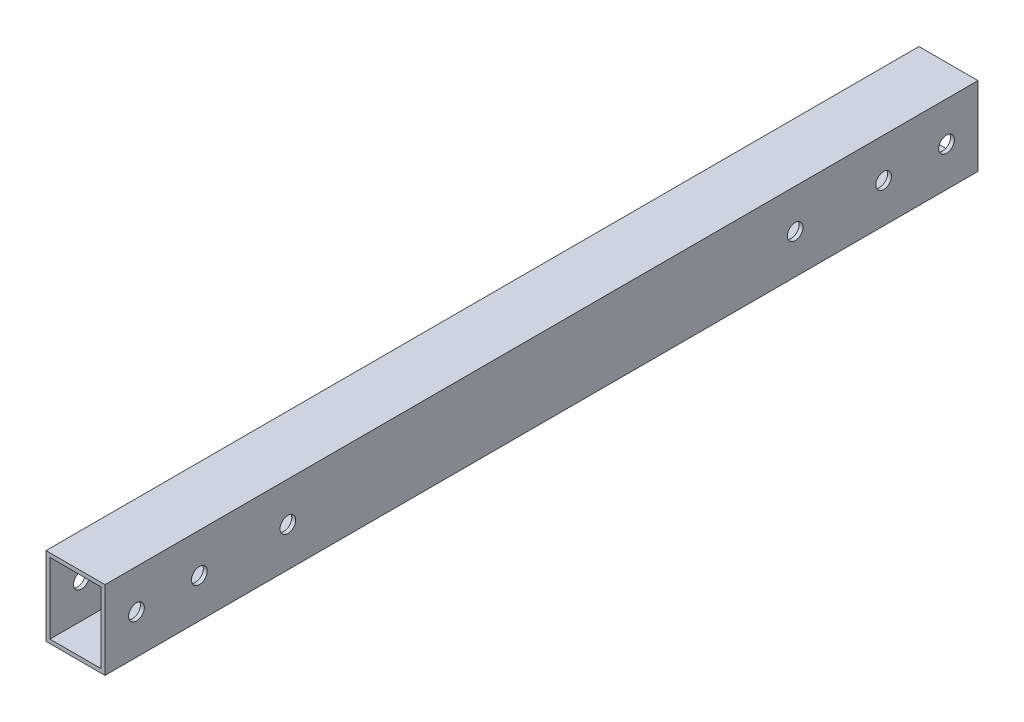
ISO-10303-21;
HEADER;
FILE_DESCRIPTION(('STEP AP214'),'2;1');
FILE_NAME('part.step','',(''),(''),'','','');
FILE_SCHEMA(('AUTOMOTIVE_DESIGN { 1 0 10303 214 1 1 1 1 }'));
ENDSEC;
DATA;
#1=APPLICATION_CONTEXT('core data for automotive mechanical design processes');
#2=APPLICATION_PROTOCOL_DEFINITION('international standard','automotive_design',2000,#1);
#3=PRODUCT_CONTEXT('',#1,'mechanical');
#4=PRODUCT('Part','Part','',(#3));
#5=PRODUCT_RELATED_PRODUCT_CATEGORY('part','',(#4));
#6=PRODUCT_DEFINITION_FORMATION('','',#4);
#7=PRODUCT_DEFINITION_CONTEXT('part definition',#1,'design');
#8=PRODUCT_DEFINITION('design','',#6,#7);
#9=PRODUCT_DEFINITION_SHAPE('','',#8);
#10=(LENGTH_UNIT() NAMED_UNIT(*) SI_UNIT(.MILLI.,.METRE.));
#11=(NAMED_UNIT(*) PLANE_ANGLE_UNIT() SI_UNIT($,.RADIAN.));
#12=(NAMED_UNIT(*) SI_UNIT($,.STERADIAN.) SOLID_ANGLE_UNIT());
#13=UNCERTAINTY_MEASURE_WITH_UNIT(LENGTH_MEASURE(1.E-05),#10,'distance_accuracy_value','');
#14=(GEOMETRIC_REPRESENTATION_CONTEXT(3) GLOBAL_UNCERTAINTY_ASSIGNED_CONTEXT((#13)) GLOBAL_UNIT_ASSIGNED_CONTEXT((#10,
#11,#12)) REPRESENTATION_CONTEXT('',''));
#15=CARTESIAN_POINT('',(0.,0.,0.));
#16=DIRECTION('',(0.,0.,1.));
#17=DIRECTION('',(1.,0.,0.));
#18=AXIS2_PLACEMENT_3D('',#15,#16,#17);
#19=CARTESIAN_POINT('',(0.,0.,444.));
#20=DIRECTION('',(0.,0.,-1.));
#21=DIRECTION('',(-1.,0.,0.));
#22=AXIS2_PLACEMENT_3D('',#19,#20,#21);
#23=PLANE('',#22);
#24=DIRECTION('',(0.,-1.,0.));
#25=VECTOR('',#24,1.);
#26=CARTESIAN_POINT('',(-18.0632084106622,-20.6910530782577,444.));
#27=LINE('',#26,#25);
#28=CARTESIAN_POINT('',(-18.0632084106622,19.3089469217423,444.));
#29=VERTEX_POINT('',#28);
#30=CARTESIAN_POINT('',(-18.0632084106622,-20.6910530782577,444.));
#31=VERTEX_POINT('',#30);
#32=EDGE_CURVE('E138',#29,#31,#27,.T.);
#33=ORIENTED_EDGE('',*,*,#32,.T.);
#34=DIRECTION('',(1.,0.,0.));
#35=VECTOR('',#34,1.);
#36=CARTESIAN_POINT('',(11.9367915893378,-20.6910530782577,444.));
#37=LINE('',#36,#35);
#38=CARTESIAN_POINT('',(11.9367915893378,-20.6910530782577,444.));
#39=VERTEX_POINT('',#38);
#40=EDGE_CURVE('E141',#31,#39,#37,.T.);
#41=ORIENTED_EDGE('',*,*,#40,.T.);
#42=DIRECTION('',(0.,1.,0.));
#43=VECTOR('',#42,1.);
#44=CARTESIAN_POINT('',(11.9367915893378,19.3089469217423,444.));
#45=LINE('',#44,#43);
#46=CARTESIAN_POINT('',(11.9367915893378,19.3089469217423,444.));
#47=VERTEX_POINT('',#46);
#48=EDGE_CURVE('E144',#39,#47,#45,.T.);
#49=ORIENTED_EDGE('',*,*,#48,.T.);
#50=DIRECTION('',(-1.,0.,0.));
#51=VECTOR('',#50,1.);
#52=CARTESIAN_POINT('',(-18.0632084106622,19.3089469217423,444.));
#53=LINE('',#52,#51);
#54=EDGE_CURVE('E146',#47,#29,#53,.T.);
#55=ORIENTED_EDGE('',*,*,#54,.T.);
#56=EDGE_LOOP('',(#33,#41,#49,#55));
#57=FACE_BOUND('',#56,.T.);
#58=DIRECTION('',(0.,-1.,0.));
#59=VECTOR('',#58,1.);
#60=CARTESIAN_POINT('',(-16.0632084106622,-18.6910530782577,444.));
#61=LINE('',#60,#59);
#62=CARTESIAN_POINT('',(-16.0632084106622,17.3089469217423,444.));
#63=VERTEX_POINT('',#62);
#64=CARTESIAN_POINT('',(-16.0632084106622,-18.6910530782577,444.));
#65=VERTEX_POINT('',#64);
#66=EDGE_CURVE('E100',#63,#65,#61,.T.);
#67=ORIENTED_EDGE('',*,*,#66,.F.);
#68=DIRECTION('',(-1.,0.,0.));
#69=VECTOR('',#68,1.);
#70=CARTESIAN_POINT('',(-16.0632084106622,17.3089469217423,444.));
#71=LINE('',#70,#69);
#72=CARTESIAN_POINT('',(9.93679158933783,17.3089469217423,444.));
#73=VERTEX_POINT('',#72);
#74=EDGE_CURVE('E122',#73,#63,#71,.T.);
#75=ORIENTED_EDGE('',*,*,#74,.F.);
#76=DIRECTION('',(0.,1.,0.));
#77=VECTOR('',#76,1.);
#78=CARTESIAN_POINT('',(9.93679158933783,17.3089469217423,444.));
#79=LINE('',#78,#77);
#80=CARTESIAN_POINT('',(9.93679158933783,-18.6910530782577,444.));
#81=VERTEX_POINT('',#80);
#82=EDGE_CURVE('E120',#81,#73,#79,.T.);
#83=ORIENTED_EDGE('',*,*,#82,.F.);
#84=DIRECTION('',(1.,0.,0.));
#85=VECTOR('',#84,1.);
#86=CARTESIAN_POINT('',(9.93679158933783,-18.6910530782577,444.));
#87=LINE('',#86,#85);
#88=EDGE_CURVE('E108',#65,#81,#87,.T.);
#89=ORIENTED_EDGE('',*,*,#88,.F.);
#90=EDGE_LOOP('',(#67,#75,#83,#89));
#91=FACE_BOUND('',#90,.T.);
#92=ADVANCED_FACE('F33',(#57,#91),#23,.F.);
#93=CARTESIAN_POINT('',(0.,0.,0.));
#94=DIRECTION('',(0.,0.,-1.));
#95=DIRECTION('',(-1.,0.,0.));
#96=AXIS2_PLACEMENT_3D('',#93,#94,#95);
#97=PLANE('',#96);
#98=DIRECTION('',(0.,-1.,0.));
#99=VECTOR('',#98,1.);
#100=CARTESIAN_POINT('',(-18.0632084106622,-20.6910530782577,0.));
#101=LINE('',#100,#99);
#102=CARTESIAN_POINT('',(-18.0632084106622,19.3089469217423,0.));
#103=VERTEX_POINT('',#102);
#104=CARTESIAN_POINT('',(-18.0632084106622,-20.6910530782577,0.));
#105=VERTEX_POINT('',#104);
#106=EDGE_CURVE('E116',#103,#105,#101,.T.);
#107=ORIENTED_EDGE('',*,*,#106,.F.);
#108=DIRECTION('',(-1.,0.,0.));
#109=VECTOR('',#108,1.);
#110=CARTESIAN_POINT('',(-18.0632084106622,19.3089469217423,0.));
#111=LINE('',#110,#109);
#112=CARTESIAN_POINT('',(11.9367915893378,19.3089469217423,0.));
#113=VERTEX_POINT('',#112);
#114=EDGE_CURVE('E142',#113,#103,#111,.T.);
#115=ORIENTED_EDGE('',*,*,#114,.F.);
#116=DIRECTION('',(0.,1.,0.));
#117=VECTOR('',#116,1.);
#118=CARTESIAN_POINT('',(11.9367915893378,19.3089469217423,0.));
#119=LINE('',#118,#117);
#120=CARTESIAN_POINT('',(11.9367915893378,-20.6910530782577,0.));
#121=VERTEX_POINT('',#120);
#122=EDGE_CURVE('E153',#121,#113,#119,.T.);
#123=ORIENTED_EDGE('',*,*,#122,.F.);
#124=DIRECTION('',(1.,0.,0.));
#125=VECTOR('',#124,1.);
#126=CARTESIAN_POINT('',(11.9367915893378,-20.6910530782577,0.));
#127=LINE('',#126,#125);
#128=EDGE_CURVE('E151',#105,#121,#127,.T.);
#129=ORIENTED_EDGE('',*,*,#128,.F.);
#130=EDGE_LOOP('',(#107,#115,#123,#129));
#131=FACE_BOUND('',#130,.T.);
#132=DIRECTION('',(-1.,0.,0.));
#133=VECTOR('',#132,1.);
#134=CARTESIAN_POINT('',(-16.0632084106622,17.3089469217423,0.));
#135=LINE('',#134,#133);
#136=CARTESIAN_POINT('',(9.93679158933783,17.3089469217423,0.));
#137=VERTEX_POINT('',#136);
#138=CARTESIAN_POINT('',(-16.0632084106622,17.3089469217423,0.));
#139=VERTEX_POINT('',#138);
#140=EDGE_CURVE('E109',#137,#139,#135,.T.);
#141=ORIENTED_EDGE('',*,*,#140,.T.);
#142=DIRECTION('',(0.,-1.,0.));
#143=VECTOR('',#142,1.);
#144=CARTESIAN_POINT('',(-16.0632084106622,-18.6910530782577,0.));
#145=LINE('',#144,#143);
#146=CARTESIAN_POINT('',(-16.0632084106622,-18.6910530782577,0.));
#147=VERTEX_POINT('',#146);
#148=EDGE_CURVE('E58',#139,#147,#145,.T.);
#149=ORIENTED_EDGE('',*,*,#148,.T.);
#150=DIRECTION('',(1.,0.,0.));
#151=VECTOR('',#150,1.);
#152=CARTESIAN_POINT('',(9.93679158933783,-18.6910530782577,0.));
#153=LINE('',#152,#151);
#154=CARTESIAN_POINT('',(9.93679158933783,-18.6910530782577,0.));
#155=VERTEX_POINT('',#154);
#156=EDGE_CURVE('E115',#147,#155,#153,.T.);
#157=ORIENTED_EDGE('',*,*,#156,.T.);
#158=DIRECTION('',(0.,1.,0.));
#159=VECTOR('',#158,1.);
#160=CARTESIAN_POINT('',(9.93679158933783,17.3089469217423,0.));
#161=LINE('',#160,#159);
#162=EDGE_CURVE('E130',#155,#137,#161,.T.);
#163=ORIENTED_EDGE('',*,*,#162,.T.);
#164=EDGE_LOOP('',(#141,#149,#157,#163));
#165=FACE_BOUND('',#164,.T.);
#166=ADVANCED_FACE('F232',(#131,#165),#97,.T.);
#167=CARTESIAN_POINT('',(-18.0632084106622,-20.6910530782577,444.));
#168=DIRECTION('',(1.,0.,0.));
#169=DIRECTION('',(0.,0.,-1.));
#170=AXIS2_PLACEMENT_3D('',#167,#168,#169);
#171=PLANE('',#170);
#172=CARTESIAN_POINT('',(-18.0632084106622,-0.69105307825773,92.9999999999596));
#173=DIRECTION('',(-1.,0.,0.));
#174=DIRECTION('',(0.,0.,1.));
#175=AXIS2_PLACEMENT_3D('',#172,#173,#174);
#176=CIRCLE('',#175,3.99999999999999);
#177=CARTESIAN_POINT('',(-18.0632084106622,-0.69105307825773,96.9999999999596));
#178=VERTEX_POINT('',#177);
#179=EDGE_CURVE('E348',#178,#178,#176,.T.);
#180=ORIENTED_EDGE('',*,*,#179,.F.);
#181=EDGE_LOOP('',(#180));
#182=FACE_BOUND('',#181,.T.);
#183=CARTESIAN_POINT('',(-18.0632084106622,-0.691053078257721,48.));
#184=DIRECTION('',(-1.,0.,0.));
#185=DIRECTION('',(0.,0.,-1.));
#186=AXIS2_PLACEMENT_3D('',#183,#184,#185);
#187=CIRCLE('',#186,3.99999999999999);
#188=CARTESIAN_POINT('',(-18.0632084106622,-0.691053078257721,44.));
#189=VERTEX_POINT('',#188);
#190=EDGE_CURVE('E346',#189,#189,#187,.T.);
#191=ORIENTED_EDGE('',*,*,#190,.F.);
#192=EDGE_LOOP('',(#191));
#193=FACE_BOUND('',#192,.T.);
#194=CARTESIAN_POINT('',(-18.0632084106622,-0.691053078257725,16.));
#195=DIRECTION('',(-1.,0.,0.));
#196=DIRECTION('',(0.,0.,-1.));
#197=AXIS2_PLACEMENT_3D('',#194,#195,#196);
#198=CIRCLE('',#197,3.99999999999999);
#199=CARTESIAN_POINT('',(-18.0632084106622,-0.691053078257725,12.));
#200=VERTEX_POINT('',#199);
#201=EDGE_CURVE('E342',#200,#200,#198,.T.);
#202=ORIENTED_EDGE('',*,*,#201,.F.);
#203=EDGE_LOOP('',(#202));
#204=FACE_BOUND('',#203,.T.);
#205=CARTESIAN_POINT('',(-18.0632084106622,-0.691053078257684,428.));
#206=DIRECTION('',(-1.,0.,0.));
#207=DIRECTION('',(0.,0.,1.));
#208=AXIS2_PLACEMENT_3D('',#205,#206,#207);
#209=CIRCLE('',#208,3.99999999999999);
#210=CARTESIAN_POINT('',(-18.0632084106622,-0.691053078257684,432.));
#211=VERTEX_POINT('',#210);
#212=EDGE_CURVE('E340',#211,#211,#209,.T.);
#213=ORIENTED_EDGE('',*,*,#212,.F.);
#214=EDGE_LOOP('',(#213));
#215=FACE_BOUND('',#214,.T.);
#216=CARTESIAN_POINT('',(-18.0632084106622,-0.691053078257716,351.00000000004));
#217=DIRECTION('',(-1.,0.,0.));
#218=DIRECTION('',(0.,0.,-1.));
#219=AXIS2_PLACEMENT_3D('',#216,#217,#218);
#220=CIRCLE('',#219,3.99999999999999);
#221=CARTESIAN_POINT('',(-18.0632084106622,-0.691053078257716,347.00000000004));
#222=VERTEX_POINT('',#221);
#223=EDGE_CURVE('E351',#222,#222,#220,.T.);
#224=ORIENTED_EDGE('',*,*,#223,.F.);
#225=EDGE_LOOP('',(#224));
#226=FACE_BOUND('',#225,.T.);
#227=CARTESIAN_POINT('',(-18.0632084106622,-0.691053078257688,396.));
#228=DIRECTION('',(-1.,0.,0.));
#229=DIRECTION('',(0.,0.,1.));
#230=AXIS2_PLACEMENT_3D('',#227,#228,#229);
#231=CIRCLE('',#230,3.99999999999999);
#232=CARTESIAN_POINT('',(-18.0632084106622,-0.691053078257688,400.));
#233=VERTEX_POINT('',#232);
#234=EDGE_CURVE('E167',#233,#233,#231,.T.);
#235=ORIENTED_EDGE('',*,*,#234,.F.);
#236=EDGE_LOOP('',(#235));
#237=FACE_BOUND('',#236,.T.);
#238=ORIENTED_EDGE('',*,*,#106,.T.);
#239=DIRECTION('',(0.,0.,-1.));
#240=VECTOR('',#239,1.);
#241=CARTESIAN_POINT('',(-18.0632084106622,-20.6910530782577,444.));
#242=LINE('',#241,#240);
#243=EDGE_CURVE('E11',#31,#105,#242,.T.);
#244=ORIENTED_EDGE('',*,*,#243,.F.);
#245=ORIENTED_EDGE('',*,*,#32,.F.);
#246=DIRECTION('',(0.,0.,-1.));
#247=VECTOR('',#246,1.);
#248=CARTESIAN_POINT('',(-18.0632084106622,19.3089469217423,444.));
#249=LINE('',#248,#247);
#250=EDGE_CURVE('E148',#29,#103,#249,.T.);
#251=ORIENTED_EDGE('',*,*,#250,.T.);
#252=EDGE_LOOP('',(#238,#244,#245,#251));
#253=FACE_BOUND('',#252,.T.);
#254=ADVANCED_FACE('F35',(#182,#193,#204,#215,#226,#237,#253),#171,.F.);
#255=CARTESIAN_POINT('',(11.9367915893378,-20.6910530782577,444.));
#256=DIRECTION('',(0.,1.,0.));
#257=DIRECTION('',(0.,0.,1.));
#258=AXIS2_PLACEMENT_3D('',#255,#256,#257);
#259=PLANE('',#258);
#260=ORIENTED_EDGE('',*,*,#128,.T.);
#261=DIRECTION('',(0.,0.,-1.));
#262=VECTOR('',#261,1.);
#263=CARTESIAN_POINT('',(11.9367915893378,-20.6910530782577,444.));
#264=LINE('',#263,#262);
#265=EDGE_CURVE('E42',#39,#121,#264,.T.);
#266=ORIENTED_EDGE('',*,*,#265,.F.);
#267=ORIENTED_EDGE('',*,*,#40,.F.);
#268=ORIENTED_EDGE('',*,*,#243,.T.);
#269=EDGE_LOOP('',(#260,#266,#267,#268));
#270=FACE_BOUND('',#269,.T.);
#271=ADVANCED_FACE('F248',(#270),#259,.F.);
#272=CARTESIAN_POINT('',(11.9367915893378,19.3089469217423,444.));
#273=DIRECTION('',(-1.,0.,0.));
#274=DIRECTION('',(0.,0.,1.));
#275=AXIS2_PLACEMENT_3D('',#272,#273,#274);
#276=PLANE('',#275);
#277=CARTESIAN_POINT('',(11.9367915893378,-0.69105307825773,92.9999999999596));
#278=DIRECTION('',(-1.,0.,0.));
#279=DIRECTION('',(0.,0.,1.));
#280=AXIS2_PLACEMENT_3D('',#277,#278,#279);
#281=CIRCLE('',#280,3.99999999999999);
#282=CARTESIAN_POINT('',(11.9367915893378,-0.69105307825773,96.9999999999596));
#283=VERTEX_POINT('',#282);
#284=EDGE_CURVE('E128',#283,#283,#281,.T.);
#285=ORIENTED_EDGE('',*,*,#284,.T.);
#286=EDGE_LOOP('',(#285));
#287=FACE_BOUND('',#286,.T.);
#288=CARTESIAN_POINT('',(11.9367915893378,-0.691053078257721,48.));
#289=DIRECTION('',(-1.,0.,0.));
#290=DIRECTION('',(0.,0.,1.));
#291=AXIS2_PLACEMENT_3D('',#288,#289,#290);
#292=CIRCLE('',#291,3.99999999999999);
#293=CARTESIAN_POINT('',(11.9367915893378,-0.691053078257721,52.));
#294=VERTEX_POINT('',#293);
#295=EDGE_CURVE('E189',#294,#294,#292,.T.);
#296=ORIENTED_EDGE('',*,*,#295,.T.);
#297=EDGE_LOOP('',(#296));
#298=FACE_BOUND('',#297,.T.);
#299=CARTESIAN_POINT('',(11.9367915893378,-0.691053078257725,16.));
#300=DIRECTION('',(-1.,0.,0.));
#301=DIRECTION('',(0.,0.,1.));
#302=AXIS2_PLACEMENT_3D('',#299,#300,#301);
#303=CIRCLE('',#302,3.99999999999999);
#304=CARTESIAN_POINT('',(11.9367915893378,-0.691053078257725,20.));
#305=VERTEX_POINT('',#304);
#306=EDGE_CURVE('E185',#305,#305,#303,.T.);
#307=ORIENTED_EDGE('',*,*,#306,.T.);
#308=EDGE_LOOP('',(#307));
#309=FACE_BOUND('',#308,.T.);
#310=CARTESIAN_POINT('',(11.9367915893378,-0.691053078257684,428.));
#311=DIRECTION('',(-1.,0.,0.));
#312=DIRECTION('',(0.,0.,1.));
#313=AXIS2_PLACEMENT_3D('',#310,#311,#312);
#314=CIRCLE('',#313,3.99999999999999);
#315=CARTESIAN_POINT('',(11.9367915893378,-0.691053078257684,432.));
#316=VERTEX_POINT('',#315);
#317=EDGE_CURVE('E181',#316,#316,#314,.T.);
#318=ORIENTED_EDGE('',*,*,#317,.T.);
#319=EDGE_LOOP('',(#318));
#320=FACE_BOUND('',#319,.T.);
#321=CARTESIAN_POINT('',(11.9367915893378,-0.691053078257716,351.00000000004));
#322=DIRECTION('',(-1.,0.,0.));
#323=DIRECTION('',(0.,0.,1.));
#324=AXIS2_PLACEMENT_3D('',#321,#322,#323);
#325=CIRCLE('',#324,3.99999999999999);
#326=CARTESIAN_POINT('',(11.9367915893378,-0.691053078257716,355.00000000004));
#327=VERTEX_POINT('',#326);
#328=EDGE_CURVE('E177',#327,#327,#325,.T.);
#329=ORIENTED_EDGE('',*,*,#328,.T.);
#330=EDGE_LOOP('',(#329));
#331=FACE_BOUND('',#330,.T.);
#332=CARTESIAN_POINT('',(11.9367915893378,-0.691053078257688,396.));
#333=DIRECTION('',(-1.,0.,0.));
#334=DIRECTION('',(0.,0.,1.));
#335=AXIS2_PLACEMENT_3D('',#332,#333,#334);
#336=CIRCLE('',#335,3.99999999999999);
#337=CARTESIAN_POINT('',(11.9367915893378,-0.691053078257688,400.));
#338=VERTEX_POINT('',#337);
#339=EDGE_CURVE('E172',#338,#338,#336,.T.);
#340=ORIENTED_EDGE('',*,*,#339,.T.);
#341=EDGE_LOOP('',(#340));
#342=FACE_BOUND('',#341,.T.);
#343=ORIENTED_EDGE('',*,*,#122,.T.);
#344=DIRECTION('',(0.,0.,-1.));
#345=VECTOR('',#344,1.);
#346=CARTESIAN_POINT('',(11.9367915893378,19.3089469217423,444.));
#347=LINE('',#346,#345);
#348=EDGE_CURVE('E158',#47,#113,#347,.T.);
#349=ORIENTED_EDGE('',*,*,#348,.F.);
#350=ORIENTED_EDGE('',*,*,#48,.F.);
#351=ORIENTED_EDGE('',*,*,#265,.T.);
#352=EDGE_LOOP('',(#343,#349,#350,#351));
#353=FACE_BOUND('',#352,.T.);
#354=ADVANCED_FACE('F206',(#287,#298,#309,#320,#331,#342,#353),#276,.F.);
#355=CARTESIAN_POINT('',(-18.0632084106622,19.3089469217423,444.));
#356=DIRECTION('',(0.,-1.,0.));
#357=DIRECTION('',(0.,0.,-1.));
#358=AXIS2_PLACEMENT_3D('',#355,#356,#357);
#359=PLANE('',#358);
#360=ORIENTED_EDGE('',*,*,#114,.T.);
#361=ORIENTED_EDGE('',*,*,#250,.F.);
#362=ORIENTED_EDGE('',*,*,#54,.F.);
#363=ORIENTED_EDGE('',*,*,#348,.T.);
#364=EDGE_LOOP('',(#360,#361,#362,#363));
#365=FACE_BOUND('',#364,.T.);
#366=ADVANCED_FACE('F243',(#365),#359,.F.);
#367=CARTESIAN_POINT('',(-16.0632084106622,-18.6910530782577,444.));
#368=DIRECTION('',(1.,0.,0.));
#369=DIRECTION('',(0.,0.,-1.));
#370=AXIS2_PLACEMENT_3D('',#367,#368,#369);
#371=PLANE('',#370);
#372=CARTESIAN_POINT('',(-16.0632084106622,-0.69105307825773,92.9999999999596));
#373=DIRECTION('',(1.,0.,0.));
#374=DIRECTION('',(0.,0.,-1.));
#375=AXIS2_PLACEMENT_3D('',#372,#373,#374);
#376=CIRCLE('',#375,3.99999999999999);
#377=CARTESIAN_POINT('',(-16.0632084106622,-0.69105307825773,88.9999999999596));
#378=VERTEX_POINT('',#377);
#379=EDGE_CURVE('E201',#378,#378,#376,.T.);
#380=ORIENTED_EDGE('',*,*,#379,.F.);
#381=EDGE_LOOP('',(#380));
#382=FACE_BOUND('',#381,.T.);
#383=CARTESIAN_POINT('',(-16.0632084106622,-0.691053078257721,48.));
#384=DIRECTION('',(1.,0.,0.));
#385=DIRECTION('',(0.,0.,-1.));
#386=AXIS2_PLACEMENT_3D('',#383,#384,#385);
#387=CIRCLE('',#386,3.99999999999999);
#388=CARTESIAN_POINT('',(-16.0632084106622,-0.691053078257721,44.));
#389=VERTEX_POINT('',#388);
#390=EDGE_CURVE('E184',#389,#389,#387,.T.);
#391=ORIENTED_EDGE('',*,*,#390,.F.);
#392=EDGE_LOOP('',(#391));
#393=FACE_BOUND('',#392,.T.);
#394=CARTESIAN_POINT('',(-16.0632084106622,-0.691053078257725,16.));
#395=DIRECTION('',(1.,0.,0.));
#396=DIRECTION('',(0.,0.,-1.));
#397=AXIS2_PLACEMENT_3D('',#394,#395,#396);
#398=CIRCLE('',#397,3.99999999999999);
#399=CARTESIAN_POINT('',(-16.0632084106622,-0.691053078257725,12.));
#400=VERTEX_POINT('',#399);
#401=EDGE_CURVE('E180',#400,#400,#398,.T.);
#402=ORIENTED_EDGE('',*,*,#401,.F.);
#403=EDGE_LOOP('',(#402));
#404=FACE_BOUND('',#403,.T.);
#405=CARTESIAN_POINT('',(-16.0632084106622,-0.691053078257684,428.));
#406=DIRECTION('',(1.,0.,0.));
#407=DIRECTION('',(0.,0.,-1.));
#408=AXIS2_PLACEMENT_3D('',#405,#406,#407);
#409=CIRCLE('',#408,3.99999999999999);
#410=CARTESIAN_POINT('',(-16.0632084106622,-0.691053078257684,424.));
#411=VERTEX_POINT('',#410);
#412=EDGE_CURVE('E176',#411,#411,#409,.T.);
#413=ORIENTED_EDGE('',*,*,#412,.F.);
#414=EDGE_LOOP('',(#413));
#415=FACE_BOUND('',#414,.T.);
#416=CARTESIAN_POINT('',(-16.0632084106622,-0.691053078257716,351.00000000004));
#417=DIRECTION('',(1.,0.,0.));
#418=DIRECTION('',(0.,0.,-1.));
#419=AXIS2_PLACEMENT_3D('',#416,#417,#418);
#420=CIRCLE('',#419,3.99999999999999);
#421=CARTESIAN_POINT('',(-16.0632084106622,-0.691053078257716,347.00000000004));
#422=VERTEX_POINT('',#421);
#423=EDGE_CURVE('E171',#422,#422,#420,.T.);
#424=ORIENTED_EDGE('',*,*,#423,.F.);
#425=EDGE_LOOP('',(#424));
#426=FACE_BOUND('',#425,.T.);
#427=CARTESIAN_POINT('',(-16.0632084106622,-0.691053078257688,396.));
#428=DIRECTION('',(1.,0.,0.));
#429=DIRECTION('',(0.,0.,-1.));
#430=AXIS2_PLACEMENT_3D('',#427,#428,#429);
#431=CIRCLE('',#430,3.99999999999999);
#432=CARTESIAN_POINT('',(-16.0632084106622,-0.691053078257688,392.));
#433=VERTEX_POINT('',#432);
#434=EDGE_CURVE('E166',#433,#433,#431,.T.);
#435=ORIENTED_EDGE('',*,*,#434,.F.);
#436=EDGE_LOOP('',(#435));
#437=FACE_BOUND('',#436,.T.);
#438=ORIENTED_EDGE('',*,*,#148,.F.);
#439=DIRECTION('',(0.,0.,-1.));
#440=VECTOR('',#439,1.);
#441=CARTESIAN_POINT('',(-16.0632084106622,17.3089469217423,444.));
#442=LINE('',#441,#440);
#443=EDGE_CURVE('E104',#63,#139,#442,.T.);
#444=ORIENTED_EDGE('',*,*,#443,.F.);
#445=ORIENTED_EDGE('',*,*,#66,.T.);
#446=DIRECTION('',(0.,0.,-1.));
#447=VECTOR('',#446,1.);
#448=CARTESIAN_POINT('',(-16.0632084106622,-18.6910530782577,444.));
#449=LINE('',#448,#447);
#450=EDGE_CURVE('E103',#65,#147,#449,.T.);
#451=ORIENTED_EDGE('',*,*,#450,.T.);
#452=EDGE_LOOP('',(#438,#444,#445,#451));
#453=FACE_BOUND('',#452,.T.);
#454=ADVANCED_FACE('F102',(#382,#393,#404,#415,#426,#437,#453),#371,.T.);
#455=CARTESIAN_POINT('',(9.93679158933783,-18.6910530782577,444.));
#456=DIRECTION('',(0.,1.,0.));
#457=DIRECTION('',(0.,0.,1.));
#458=AXIS2_PLACEMENT_3D('',#455,#456,#457);
#459=PLANE('',#458);
#460=ORIENTED_EDGE('',*,*,#156,.F.);
#461=ORIENTED_EDGE('',*,*,#450,.F.);
#462=ORIENTED_EDGE('',*,*,#88,.T.);
#463=DIRECTION('',(0.,0.,-1.));
#464=VECTOR('',#463,1.);
#465=CARTESIAN_POINT('',(9.93679158933783,-18.6910530782577,444.));
#466=LINE('',#465,#464);
#467=EDGE_CURVE('E117',#81,#155,#466,.T.);
#468=ORIENTED_EDGE('',*,*,#467,.T.);
#469=EDGE_LOOP('',(#460,#461,#462,#468));
#470=FACE_BOUND('',#469,.T.);
#471=ADVANCED_FACE('F112',(#470),#459,.T.);
#472=CARTESIAN_POINT('',(9.93679158933783,17.3089469217423,444.));
#473=DIRECTION('',(-1.,0.,0.));
#474=DIRECTION('',(0.,0.,1.));
#475=AXIS2_PLACEMENT_3D('',#472,#473,#474);
#476=PLANE('',#475);
#477=CARTESIAN_POINT('',(9.93679158933783,-0.69105307825773,92.9999999999596));
#478=DIRECTION('',(-1.,0.,0.));
#479=DIRECTION('',(0.,0.,1.));
#480=AXIS2_PLACEMENT_3D('',#477,#478,#479);
#481=CIRCLE('',#480,3.99999999999999);
#482=CARTESIAN_POINT('',(9.93679158933783,-0.69105307825773,96.9999999999596));
#483=VERTEX_POINT('',#482);
#484=EDGE_CURVE('E37',#483,#483,#481,.T.);
#485=ORIENTED_EDGE('',*,*,#484,.F.);
#486=EDGE_LOOP('',(#485));
#487=FACE_BOUND('',#486,.T.);
#488=CARTESIAN_POINT('',(9.93679158933783,-0.691053078257721,48.));
#489=DIRECTION('',(-1.,0.,0.));
#490=DIRECTION('',(0.,0.,1.));
#491=AXIS2_PLACEMENT_3D('',#488,#489,#490);
#492=CIRCLE('',#491,3.99999999999999);
#493=CARTESIAN_POINT('',(9.93679158933783,-0.691053078257721,52.));
#494=VERTEX_POINT('',#493);
#495=EDGE_CURVE('E182',#494,#494,#492,.T.);
#496=ORIENTED_EDGE('',*,*,#495,.F.);
#497=EDGE_LOOP('',(#496));
#498=FACE_BOUND('',#497,.T.);
#499=CARTESIAN_POINT('',(9.93679158933783,-0.691053078257725,16.));
#500=DIRECTION('',(-1.,0.,0.));
#501=DIRECTION('',(0.,0.,1.));
#502=AXIS2_PLACEMENT_3D('',#499,#500,#501);
#503=CIRCLE('',#502,3.99999999999999);
#504=CARTESIAN_POINT('',(9.93679158933783,-0.691053078257725,20.));
#505=VERTEX_POINT('',#504);
#506=EDGE_CURVE('E178',#505,#505,#503,.T.);
#507=ORIENTED_EDGE('',*,*,#506,.F.);
#508=EDGE_LOOP('',(#507));
#509=FACE_BOUND('',#508,.T.);
#510=CARTESIAN_POINT('',(9.93679158933783,-0.691053078257684,428.));
#511=DIRECTION('',(-1.,0.,0.));
#512=DIRECTION('',(0.,0.,1.));
#513=AXIS2_PLACEMENT_3D('',#510,#511,#512);
#514=CIRCLE('',#513,3.99999999999999);
#515=CARTESIAN_POINT('',(9.93679158933783,-0.691053078257684,432.));
#516=VERTEX_POINT('',#515);
#517=EDGE_CURVE('E173',#516,#516,#514,.T.);
#518=ORIENTED_EDGE('',*,*,#517,.F.);
#519=EDGE_LOOP('',(#518));
#520=FACE_BOUND('',#519,.T.);
#521=CARTESIAN_POINT('',(9.93679158933783,-0.691053078257716,351.00000000004));
#522=DIRECTION('',(-1.,0.,0.));
#523=DIRECTION('',(0.,0.,1.));
#524=AXIS2_PLACEMENT_3D('',#521,#522,#523);
#525=CIRCLE('',#524,3.99999999999999);
#526=CARTESIAN_POINT('',(9.93679158933783,-0.691053078257716,355.00000000004));
#527=VERTEX_POINT('',#526);
#528=EDGE_CURVE('E168',#527,#527,#525,.T.);
#529=ORIENTED_EDGE('',*,*,#528,.F.);
#530=EDGE_LOOP('',(#529));
#531=FACE_BOUND('',#530,.T.);
#532=CARTESIAN_POINT('',(9.93679158933783,-0.691053078257688,396.));
#533=DIRECTION('',(-1.,0.,0.));
#534=DIRECTION('',(0.,0.,1.));
#535=AXIS2_PLACEMENT_3D('',#532,#533,#534);
#536=CIRCLE('',#535,3.99999999999999);
#537=CARTESIAN_POINT('',(9.93679158933783,-0.691053078257688,400.));
#538=VERTEX_POINT('',#537);
#539=EDGE_CURVE('E163',#538,#538,#536,.T.);
#540=ORIENTED_EDGE('',*,*,#539,.F.);
#541=EDGE_LOOP('',(#540));
#542=FACE_BOUND('',#541,.T.);
#543=ORIENTED_EDGE('',*,*,#162,.F.);
#544=ORIENTED_EDGE('',*,*,#467,.F.);
#545=ORIENTED_EDGE('',*,*,#82,.T.);
#546=DIRECTION('',(0.,0.,-1.));
#547=VECTOR('',#546,1.);
#548=CARTESIAN_POINT('',(9.93679158933783,17.3089469217423,444.));
#549=LINE('',#548,#547);
#550=EDGE_CURVE('E50',#73,#137,#549,.T.);
#551=ORIENTED_EDGE('',*,*,#550,.T.);
#552=EDGE_LOOP('',(#543,#544,#545,#551));
#553=FACE_BOUND('',#552,.T.);
#554=ADVANCED_FACE('F271',(#487,#498,#509,#520,#531,#542,#553),#476,.T.);
#555=CARTESIAN_POINT('',(-16.0632084106622,17.3089469217423,444.));
#556=DIRECTION('',(0.,-1.,0.));
#557=DIRECTION('',(0.,0.,-1.));
#558=AXIS2_PLACEMENT_3D('',#555,#556,#557);
#559=PLANE('',#558);
#560=ORIENTED_EDGE('',*,*,#140,.F.);
#561=ORIENTED_EDGE('',*,*,#550,.F.);
#562=ORIENTED_EDGE('',*,*,#74,.T.);
#563=ORIENTED_EDGE('',*,*,#443,.T.);
#564=EDGE_LOOP('',(#560,#561,#562,#563));
#565=FACE_BOUND('',#564,.T.);
#566=ADVANCED_FACE('F269',(#565),#559,.T.);
#567=CARTESIAN_POINT('',(77.9367915893379,-0.691053078257688,396.));
#568=DIRECTION('',(-1.,0.,0.));
#569=DIRECTION('',(0.,0.,1.));
#570=AXIS2_PLACEMENT_3D('',#567,#568,#569);
#571=CYLINDRICAL_SURFACE('',#570,3.99999999999999);
#572=ORIENTED_EDGE('',*,*,#539,.T.);
#573=EDGE_LOOP('',(#572));
#574=FACE_BOUND('',#573,.T.);
#575=ORIENTED_EDGE('',*,*,#339,.F.);
#576=EDGE_LOOP('',(#575));
#577=FACE_BOUND('',#576,.T.);
#578=ADVANCED_FACE('F223',(#574,#577),#571,.F.);
#579=CARTESIAN_POINT('',(77.9367915893379,-0.691053078257716,351.00000000004));
#580=DIRECTION('',(-1.,0.,0.));
#581=DIRECTION('',(0.,0.,1.));
#582=AXIS2_PLACEMENT_3D('',#579,#580,#581);
#583=CYLINDRICAL_SURFACE('',#582,3.99999999999999);
#584=ORIENTED_EDGE('',*,*,#528,.T.);
#585=EDGE_LOOP('',(#584));
#586=FACE_BOUND('',#585,.T.);
#587=ORIENTED_EDGE('',*,*,#328,.F.);
#588=EDGE_LOOP('',(#587));
#589=FACE_BOUND('',#588,.T.);
#590=ADVANCED_FACE('F277',(#586,#589),#583,.F.);
#591=CARTESIAN_POINT('',(77.9367915893379,-0.691053078257684,428.));
#592=DIRECTION('',(-1.,0.,0.));
#593=DIRECTION('',(0.,0.,1.));
#594=AXIS2_PLACEMENT_3D('',#591,#592,#593);
#595=CYLINDRICAL_SURFACE('',#594,3.99999999999999);
#596=ORIENTED_EDGE('',*,*,#517,.T.);
#597=EDGE_LOOP('',(#596));
#598=FACE_BOUND('',#597,.T.);
#599=ORIENTED_EDGE('',*,*,#317,.F.);
#600=EDGE_LOOP('',(#599));
#601=FACE_BOUND('',#600,.T.);
#602=ADVANCED_FACE('F317',(#598,#601),#595,.F.);
#603=CARTESIAN_POINT('',(77.9367915893379,-0.691053078257725,16.));
#604=DIRECTION('',(-1.,0.,0.));
#605=DIRECTION('',(0.,0.,1.));
#606=AXIS2_PLACEMENT_3D('',#603,#604,#605);
#607=CYLINDRICAL_SURFACE('',#606,3.99999999999999);
#608=ORIENTED_EDGE('',*,*,#506,.T.);
#609=EDGE_LOOP('',(#608));
#610=FACE_BOUND('',#609,.T.);
#611=ORIENTED_EDGE('',*,*,#306,.F.);
#612=EDGE_LOOP('',(#611));
#613=FACE_BOUND('',#612,.T.);
#614=ADVANCED_FACE('F224',(#610,#613),#607,.F.);
#615=CARTESIAN_POINT('',(77.9367915893379,-0.691053078257721,48.));
#616=DIRECTION('',(-1.,0.,0.));
#617=DIRECTION('',(0.,0.,1.));
#618=AXIS2_PLACEMENT_3D('',#615,#616,#617);
#619=CYLINDRICAL_SURFACE('',#618,3.99999999999999);
#620=ORIENTED_EDGE('',*,*,#495,.T.);
#621=EDGE_LOOP('',(#620));
#622=FACE_BOUND('',#621,.T.);
#623=ORIENTED_EDGE('',*,*,#295,.F.);
#624=EDGE_LOOP('',(#623));
#625=FACE_BOUND('',#624,.T.);
#626=ADVANCED_FACE('F212',(#622,#625),#619,.F.);
#627=CARTESIAN_POINT('',(77.9367915893379,-0.69105307825773,92.9999999999596));
#628=DIRECTION('',(-1.,0.,0.));
#629=DIRECTION('',(0.,0.,1.));
#630=AXIS2_PLACEMENT_3D('',#627,#628,#629);
#631=CYLINDRICAL_SURFACE('',#630,3.99999999999999);
#632=ORIENTED_EDGE('',*,*,#484,.T.);
#633=EDGE_LOOP('',(#632));
#634=FACE_BOUND('',#633,.T.);
#635=ORIENTED_EDGE('',*,*,#284,.F.);
#636=EDGE_LOOP('',(#635));
#637=FACE_BOUND('',#636,.T.);
#638=ADVANCED_FACE('F209',(#634,#637),#631,.F.);
#639=ORIENTED_EDGE('',*,*,#434,.T.);
#640=EDGE_LOOP('',(#639));
#641=FACE_BOUND('',#640,.T.);
#642=ORIENTED_EDGE('',*,*,#234,.T.);
#643=EDGE_LOOP('',(#642));
#644=FACE_BOUND('',#643,.T.);
#645=ADVANCED_FACE('F211',(#641,#644),#571,.F.);
#646=ORIENTED_EDGE('',*,*,#423,.T.);
#647=EDGE_LOOP('',(#646));
#648=FACE_BOUND('',#647,.T.);
#649=ORIENTED_EDGE('',*,*,#223,.T.);
#650=EDGE_LOOP('',(#649));
#651=FACE_BOUND('',#650,.T.);
#652=ADVANCED_FACE('F220',(#648,#651),#583,.F.);
#653=ORIENTED_EDGE('',*,*,#412,.T.);
#654=EDGE_LOOP('',(#653));
#655=FACE_BOUND('',#654,.T.);
#656=ORIENTED_EDGE('',*,*,#212,.T.);
#657=EDGE_LOOP('',(#656));
#658=FACE_BOUND('',#657,.T.);
#659=ADVANCED_FACE('F320',(#655,#658),#595,.F.);
#660=ORIENTED_EDGE('',*,*,#401,.T.);
#661=EDGE_LOOP('',(#660));
#662=FACE_BOUND('',#661,.T.);
#663=ORIENTED_EDGE('',*,*,#201,.T.);
#664=EDGE_LOOP('',(#663));
#665=FACE_BOUND('',#664,.T.);
#666=ADVANCED_FACE('F326',(#662,#665),#607,.F.);
#667=ORIENTED_EDGE('',*,*,#390,.T.);
#668=EDGE_LOOP('',(#667));
#669=FACE_BOUND('',#668,.T.);
#670=ORIENTED_EDGE('',*,*,#190,.T.);
#671=EDGE_LOOP('',(#670));
#672=FACE_BOUND('',#671,.T.);
#673=ADVANCED_FACE('F226',(#669,#672),#619,.F.);
#674=ORIENTED_EDGE('',*,*,#379,.T.);
#675=EDGE_LOOP('',(#674));
#676=FACE_BOUND('',#675,.T.);
#677=ORIENTED_EDGE('',*,*,#179,.T.);
#678=EDGE_LOOP('',(#677));
#679=FACE_BOUND('',#678,.T.);
#680=ADVANCED_FACE('F215',(#676,#679),#631,.F.);
#681=CLOSED_SHELL('',(#92,#166,#254,#271,#354,#366,#454,#471,#554,#566,#578,#590,#602,#614,#626,
#638,#645,#652,#659,#666,#673,#680));
#682=MANIFOLD_SOLID_BREP('B2',#681);
#683=ADVANCED_BREP_SHAPE_REPRESENTATION('',(#18,#682),#14);
#684=SHAPE_DEFINITION_REPRESENTATION(#9,#683);
ENDSEC;
END-ISO-10303-21;
